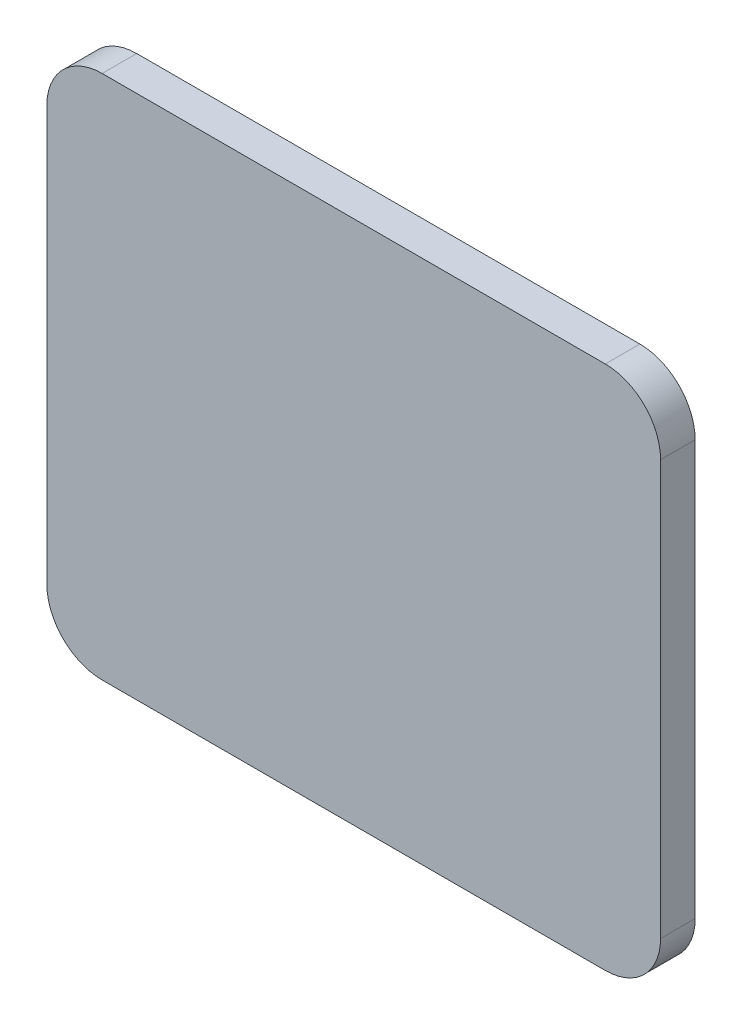
ISO-10303-21;
HEADER;
FILE_DESCRIPTION(('STEP AP214'),'2;1');
FILE_NAME('part.step','',(''),(''),'','','');
FILE_SCHEMA(('AUTOMOTIVE_DESIGN { 1 0 10303 214 1 1 1 1 }'));
ENDSEC;
DATA;
#1=APPLICATION_CONTEXT('core data for automotive mechanical design processes');
#2=APPLICATION_PROTOCOL_DEFINITION('international standard','automotive_design',2000,#1);
#3=PRODUCT_CONTEXT('',#1,'mechanical');
#4=PRODUCT('Part','Part','',(#3));
#5=PRODUCT_RELATED_PRODUCT_CATEGORY('part','',(#4));
#6=PRODUCT_DEFINITION_FORMATION('','',#4);
#7=PRODUCT_DEFINITION_CONTEXT('part definition',#1,'design');
#8=PRODUCT_DEFINITION('design','',#6,#7);
#9=PRODUCT_DEFINITION_SHAPE('','',#8);
#10=(LENGTH_UNIT() NAMED_UNIT(*) SI_UNIT(.MILLI.,.METRE.));
#11=(NAMED_UNIT(*) PLANE_ANGLE_UNIT() SI_UNIT($,.RADIAN.));
#12=(NAMED_UNIT(*) SI_UNIT($,.STERADIAN.) SOLID_ANGLE_UNIT());
#13=UNCERTAINTY_MEASURE_WITH_UNIT(LENGTH_MEASURE(1.E-05),#10,'distance_accuracy_value','');
#14=(GEOMETRIC_REPRESENTATION_CONTEXT(3) GLOBAL_UNCERTAINTY_ASSIGNED_CONTEXT((#13)) GLOBAL_UNIT_ASSIGNED_CONTEXT((#10,
#11,#12)) REPRESENTATION_CONTEXT('',''));
#15=CARTESIAN_POINT('',(0.,0.,0.));
#16=DIRECTION('',(0.,0.,1.));
#17=DIRECTION('',(1.,0.,0.));
#18=AXIS2_PLACEMENT_3D('',#15,#16,#17);
#19=CARTESIAN_POINT('',(-11.557,-9.525,1.5875));
#20=DIRECTION('',(0.,0.,-1.));
#21=DIRECTION('',(-1.,0.,0.));
#22=AXIS2_PLACEMENT_3D('',#19,#20,#21);
#23=CYLINDRICAL_SURFACE('',#22,2.54);
#24=CARTESIAN_POINT('',(-11.557,-9.525,0.));
#25=DIRECTION('',(0.,0.,1.));
#26=DIRECTION('',(-1.,0.,0.));
#27=AXIS2_PLACEMENT_3D('',#24,#25,#26);
#28=CIRCLE('',#27,2.54);
#29=CARTESIAN_POINT('',(-14.097,-9.52499999999998,0.));
#30=VERTEX_POINT('',#29);
#31=CARTESIAN_POINT('',(-11.557,-12.065,0.));
#32=VERTEX_POINT('',#31);
#33=EDGE_CURVE('E130',#30,#32,#28,.T.);
#34=ORIENTED_EDGE('',*,*,#33,.T.);
#35=DIRECTION('',(0.,0.,-1.));
#36=VECTOR('',#35,1.);
#37=CARTESIAN_POINT('',(-11.557,-12.065,1.5875));
#38=LINE('',#37,#36);
#39=CARTESIAN_POINT('',(-11.557,-12.065,1.5875));
#40=VERTEX_POINT('',#39);
#41=EDGE_CURVE('E11',#40,#32,#38,.T.);
#42=ORIENTED_EDGE('',*,*,#41,.F.);
#43=CARTESIAN_POINT('',(-11.557,-9.525,1.5875));
#44=DIRECTION('',(0.,0.,1.));
#45=DIRECTION('',(-1.,0.,0.));
#46=AXIS2_PLACEMENT_3D('',#43,#44,#45);
#47=CIRCLE('',#46,2.54);
#48=CARTESIAN_POINT('',(-14.097,-9.52499999999998,1.5875));
#49=VERTEX_POINT('',#48);
#50=EDGE_CURVE('E144',#49,#40,#47,.T.);
#51=ORIENTED_EDGE('',*,*,#50,.F.);
#52=DIRECTION('',(0.,0.,-1.));
#53=VECTOR('',#52,1.);
#54=CARTESIAN_POINT('',(-14.097,-9.52499999999998,1.5875));
#55=LINE('',#54,#53);
#56=EDGE_CURVE('E126',#49,#30,#55,.T.);
#57=ORIENTED_EDGE('',*,*,#56,.T.);
#58=EDGE_LOOP('',(#34,#42,#51,#57));
#59=FACE_BOUND('',#58,.T.);
#60=ADVANCED_FACE('F34',(#59),#23,.T.);
#61=CARTESIAN_POINT('',(11.557,-12.065,1.5875));
#62=DIRECTION('',(0.,1.,0.));
#63=DIRECTION('',(-1.,0.,0.));
#64=AXIS2_PLACEMENT_3D('',#61,#62,#63);
#65=PLANE('',#64);
#66=DIRECTION('',(1.,0.,0.));
#67=VECTOR('',#66,1.);
#68=CARTESIAN_POINT('',(11.557,-12.065,0.));
#69=LINE('',#68,#67);
#70=CARTESIAN_POINT('',(11.557,-12.065,0.));
#71=VERTEX_POINT('',#70);
#72=EDGE_CURVE('E133',#32,#71,#69,.T.);
#73=ORIENTED_EDGE('',*,*,#72,.T.);
#74=DIRECTION('',(0.,0.,-1.));
#75=VECTOR('',#74,1.);
#76=CARTESIAN_POINT('',(11.557,-12.065,1.5875));
#77=LINE('',#76,#75);
#78=CARTESIAN_POINT('',(11.557,-12.065,1.5875));
#79=VERTEX_POINT('',#78);
#80=EDGE_CURVE('E42',#79,#71,#77,.T.);
#81=ORIENTED_EDGE('',*,*,#80,.F.);
#82=DIRECTION('',(1.,0.,0.));
#83=VECTOR('',#82,1.);
#84=CARTESIAN_POINT('',(11.557,-12.065,1.5875));
#85=LINE('',#84,#83);
#86=EDGE_CURVE('E93',#40,#79,#85,.T.);
#87=ORIENTED_EDGE('',*,*,#86,.F.);
#88=ORIENTED_EDGE('',*,*,#41,.T.);
#89=EDGE_LOOP('',(#73,#81,#87,#88));
#90=FACE_BOUND('',#89,.T.);
#91=ADVANCED_FACE('F179',(#90),#65,.F.);
#92=CARTESIAN_POINT('',(11.557,-9.525,1.5875));
#93=DIRECTION('',(0.,0.,-1.));
#94=DIRECTION('',(-1.,0.,0.));
#95=AXIS2_PLACEMENT_3D('',#92,#93,#94);
#96=CYLINDRICAL_SURFACE('',#95,2.54);
#97=CARTESIAN_POINT('',(11.557,-9.525,0.));
#98=DIRECTION('',(0.,0.,1.));
#99=DIRECTION('',(1.,0.,0.));
#100=AXIS2_PLACEMENT_3D('',#97,#98,#99);
#101=CIRCLE('',#100,2.54);
#102=CARTESIAN_POINT('',(14.097,-9.52499999999998,0.));
#103=VERTEX_POINT('',#102);
#104=EDGE_CURVE('E135',#71,#103,#101,.T.);
#105=ORIENTED_EDGE('',*,*,#104,.T.);
#106=DIRECTION('',(0.,0.,-1.));
#107=VECTOR('',#106,1.);
#108=CARTESIAN_POINT('',(14.097,-9.52499999999998,1.5875));
#109=LINE('',#108,#107);
#110=CARTESIAN_POINT('',(14.097,-9.52499999999998,1.5875));
#111=VERTEX_POINT('',#110);
#112=EDGE_CURVE('E151',#111,#103,#109,.T.);
#113=ORIENTED_EDGE('',*,*,#112,.F.);
#114=CARTESIAN_POINT('',(11.557,-9.525,1.5875));
#115=DIRECTION('',(0.,0.,1.));
#116=DIRECTION('',(1.,0.,0.));
#117=AXIS2_PLACEMENT_3D('',#114,#115,#116);
#118=CIRCLE('',#117,2.54);
#119=EDGE_CURVE('E159',#79,#111,#118,.T.);
#120=ORIENTED_EDGE('',*,*,#119,.F.);
#121=ORIENTED_EDGE('',*,*,#80,.T.);
#122=EDGE_LOOP('',(#105,#113,#120,#121));
#123=FACE_BOUND('',#122,.T.);
#124=ADVANCED_FACE('F157',(#123),#96,.T.);
#125=CARTESIAN_POINT('',(14.097,-9.52499999999998,1.5875));
#126=DIRECTION('',(-1.,0.,0.));
#127=DIRECTION('',(0.,0.,1.));
#128=AXIS2_PLACEMENT_3D('',#125,#126,#127);
#129=PLANE('',#128);
#130=DIRECTION('',(0.,1.,0.));
#131=VECTOR('',#130,1.);
#132=CARTESIAN_POINT('',(14.097,-9.52499999999998,0.));
#133=LINE('',#132,#131);
#134=CARTESIAN_POINT('',(14.097,9.52499999999998,0.));
#135=VERTEX_POINT('',#134);
#136=EDGE_CURVE('E137',#103,#135,#133,.T.);
#137=ORIENTED_EDGE('',*,*,#136,.T.);
#138=DIRECTION('',(0.,0.,-1.));
#139=VECTOR('',#138,1.);
#140=CARTESIAN_POINT('',(14.097,9.52499999999998,1.5875));
#141=LINE('',#140,#139);
#142=CARTESIAN_POINT('',(14.097,9.52499999999998,1.5875));
#143=VERTEX_POINT('',#142);
#144=EDGE_CURVE('E148',#143,#135,#141,.T.);
#145=ORIENTED_EDGE('',*,*,#144,.F.);
#146=DIRECTION('',(0.,1.,0.));
#147=VECTOR('',#146,1.);
#148=CARTESIAN_POINT('',(14.097,-9.52499999999998,1.5875));
#149=LINE('',#148,#147);
#150=EDGE_CURVE('E171',#111,#143,#149,.T.);
#151=ORIENTED_EDGE('',*,*,#150,.F.);
#152=ORIENTED_EDGE('',*,*,#112,.T.);
#153=EDGE_LOOP('',(#137,#145,#151,#152));
#154=FACE_BOUND('',#153,.T.);
#155=ADVANCED_FACE('F167',(#154),#129,.F.);
#156=CARTESIAN_POINT('',(11.557,9.525,1.5875));
#157=DIRECTION('',(0.,0.,-1.));
#158=DIRECTION('',(-1.,0.,0.));
#159=AXIS2_PLACEMENT_3D('',#156,#157,#158);
#160=CYLINDRICAL_SURFACE('',#159,2.54);
#161=CARTESIAN_POINT('',(11.557,9.525,0.));
#162=DIRECTION('',(0.,0.,1.));
#163=DIRECTION('',(1.,0.,0.));
#164=AXIS2_PLACEMENT_3D('',#161,#162,#163);
#165=CIRCLE('',#164,2.54);
#166=CARTESIAN_POINT('',(11.557,12.065,0.));
#167=VERTEX_POINT('',#166);
#168=EDGE_CURVE('E139',#135,#167,#165,.T.);
#169=ORIENTED_EDGE('',*,*,#168,.T.);
#170=DIRECTION('',(0.,0.,-1.));
#171=VECTOR('',#170,1.);
#172=CARTESIAN_POINT('',(11.557,12.065,1.5875));
#173=LINE('',#172,#171);
#174=CARTESIAN_POINT('',(11.557,12.065,1.5875));
#175=VERTEX_POINT('',#174);
#176=EDGE_CURVE('E121',#175,#167,#173,.T.);
#177=ORIENTED_EDGE('',*,*,#176,.F.);
#178=CARTESIAN_POINT('',(11.557,9.525,1.5875));
#179=DIRECTION('',(0.,0.,1.));
#180=DIRECTION('',(1.,0.,0.));
#181=AXIS2_PLACEMENT_3D('',#178,#179,#180);
#182=CIRCLE('',#181,2.54);
#183=EDGE_CURVE('E112',#143,#175,#182,.T.);
#184=ORIENTED_EDGE('',*,*,#183,.F.);
#185=ORIENTED_EDGE('',*,*,#144,.T.);
#186=EDGE_LOOP('',(#169,#177,#184,#185));
#187=FACE_BOUND('',#186,.T.);
#188=ADVANCED_FACE('F170',(#187),#160,.T.);
#189=CARTESIAN_POINT('',(11.557,12.065,1.5875));
#190=DIRECTION('',(0.,-1.,0.));
#191=DIRECTION('',(1.,0.,0.));
#192=AXIS2_PLACEMENT_3D('',#189,#190,#191);
#193=PLANE('',#192);
#194=DIRECTION('',(-1.,0.,0.));
#195=VECTOR('',#194,1.);
#196=CARTESIAN_POINT('',(11.557,12.065,0.));
#197=LINE('',#196,#195);
#198=CARTESIAN_POINT('',(-11.557,12.065,0.));
#199=VERTEX_POINT('',#198);
#200=EDGE_CURVE('E120',#167,#199,#197,.T.);
#201=ORIENTED_EDGE('',*,*,#200,.T.);
#202=DIRECTION('',(0.,0.,-1.));
#203=VECTOR('',#202,1.);
#204=CARTESIAN_POINT('',(-11.557,12.065,1.5875));
#205=LINE('',#204,#203);
#206=CARTESIAN_POINT('',(-11.557,12.065,1.5875));
#207=VERTEX_POINT('',#206);
#208=EDGE_CURVE('E117',#207,#199,#205,.T.);
#209=ORIENTED_EDGE('',*,*,#208,.F.);
#210=DIRECTION('',(-1.,0.,0.));
#211=VECTOR('',#210,1.);
#212=CARTESIAN_POINT('',(11.557,12.065,1.5875));
#213=LINE('',#212,#211);
#214=EDGE_CURVE('E106',#175,#207,#213,.T.);
#215=ORIENTED_EDGE('',*,*,#214,.F.);
#216=ORIENTED_EDGE('',*,*,#176,.T.);
#217=EDGE_LOOP('',(#201,#209,#215,#216));
#218=FACE_BOUND('',#217,.T.);
#219=ADVANCED_FACE('F118',(#218),#193,.F.);
#220=CARTESIAN_POINT('',(-11.557,9.525,1.5875));
#221=DIRECTION('',(0.,0.,-1.));
#222=DIRECTION('',(-1.,0.,0.));
#223=AXIS2_PLACEMENT_3D('',#220,#221,#222);
#224=CYLINDRICAL_SURFACE('',#223,2.54);
#225=CARTESIAN_POINT('',(-11.557,9.525,0.));
#226=DIRECTION('',(0.,0.,1.));
#227=DIRECTION('',(1.,0.,0.));
#228=AXIS2_PLACEMENT_3D('',#225,#226,#227);
#229=CIRCLE('',#228,2.54);
#230=CARTESIAN_POINT('',(-14.097,9.52499999999998,0.));
#231=VERTEX_POINT('',#230);
#232=EDGE_CURVE('E79',#199,#231,#229,.T.);
#233=ORIENTED_EDGE('',*,*,#232,.T.);
#234=DIRECTION('',(0.,0.,-1.));
#235=VECTOR('',#234,1.);
#236=CARTESIAN_POINT('',(-14.097,9.52499999999998,1.5875));
#237=LINE('',#236,#235);
#238=CARTESIAN_POINT('',(-14.097,9.52499999999998,1.5875));
#239=VERTEX_POINT('',#238);
#240=EDGE_CURVE('E122',#239,#231,#237,.T.);
#241=ORIENTED_EDGE('',*,*,#240,.F.);
#242=CARTESIAN_POINT('',(-11.557,9.525,1.5875));
#243=DIRECTION('',(0.,0.,1.));
#244=DIRECTION('',(1.,0.,0.));
#245=AXIS2_PLACEMENT_3D('',#242,#243,#244);
#246=CIRCLE('',#245,2.54);
#247=EDGE_CURVE('E110',#207,#239,#246,.T.);
#248=ORIENTED_EDGE('',*,*,#247,.F.);
#249=ORIENTED_EDGE('',*,*,#208,.T.);
#250=EDGE_LOOP('',(#233,#241,#248,#249));
#251=FACE_BOUND('',#250,.T.);
#252=ADVANCED_FACE('F124',(#251),#224,.T.);
#253=CARTESIAN_POINT('',(-14.097,-9.52499999999998,1.5875));
#254=DIRECTION('',(1.,0.,0.));
#255=DIRECTION('',(0.,0.,-1.));
#256=AXIS2_PLACEMENT_3D('',#253,#254,#255);
#257=PLANE('',#256);
#258=DIRECTION('',(0.,-1.,0.));
#259=VECTOR('',#258,1.);
#260=CARTESIAN_POINT('',(-14.097,-9.52499999999998,0.));
#261=LINE('',#260,#259);
#262=EDGE_CURVE('E85',#231,#30,#261,.T.);
#263=ORIENTED_EDGE('',*,*,#262,.T.);
#264=ORIENTED_EDGE('',*,*,#56,.F.);
#265=DIRECTION('',(0.,-1.,0.));
#266=VECTOR('',#265,1.);
#267=CARTESIAN_POINT('',(-14.097,-9.52499999999998,1.5875));
#268=LINE('',#267,#266);
#269=EDGE_CURVE('E50',#239,#49,#268,.T.);
#270=ORIENTED_EDGE('',*,*,#269,.F.);
#271=ORIENTED_EDGE('',*,*,#240,.T.);
#272=EDGE_LOOP('',(#263,#264,#270,#271));
#273=FACE_BOUND('',#272,.T.);
#274=ADVANCED_FACE('F195',(#273),#257,.F.);
#275=CARTESIAN_POINT('',(-11.557,-9.525,1.5875));
#276=DIRECTION('',(0.,0.,-1.));
#277=DIRECTION('',(-1.,0.,0.));
#278=AXIS2_PLACEMENT_3D('',#275,#276,#277);
#279=PLANE('',#278);
#280=ORIENTED_EDGE('',*,*,#50,.T.);
#281=ORIENTED_EDGE('',*,*,#86,.T.);
#282=ORIENTED_EDGE('',*,*,#119,.T.);
#283=ORIENTED_EDGE('',*,*,#150,.T.);
#284=ORIENTED_EDGE('',*,*,#183,.T.);
#285=ORIENTED_EDGE('',*,*,#214,.T.);
#286=ORIENTED_EDGE('',*,*,#247,.T.);
#287=ORIENTED_EDGE('',*,*,#269,.T.);
#288=EDGE_LOOP('',(#280,#281,#282,#283,#284,#285,#286,#287));
#289=FACE_BOUND('',#288,.T.);
#290=ADVANCED_FACE('F108',(#289),#279,.F.);
#291=CARTESIAN_POINT('',(-11.557,-9.525,0.));
#292=DIRECTION('',(0.,0.,-1.));
#293=DIRECTION('',(-1.,0.,0.));
#294=AXIS2_PLACEMENT_3D('',#291,#292,#293);
#295=PLANE('',#294);
#296=ORIENTED_EDGE('',*,*,#33,.F.);
#297=ORIENTED_EDGE('',*,*,#262,.F.);
#298=ORIENTED_EDGE('',*,*,#232,.F.);
#299=ORIENTED_EDGE('',*,*,#200,.F.);
#300=ORIENTED_EDGE('',*,*,#168,.F.);
#301=ORIENTED_EDGE('',*,*,#136,.F.);
#302=ORIENTED_EDGE('',*,*,#104,.F.);
#303=ORIENTED_EDGE('',*,*,#72,.F.);
#304=EDGE_LOOP('',(#296,#297,#298,#299,#300,#301,#302,#303));
#305=FACE_BOUND('',#304,.T.);
#306=ADVANCED_FACE('F163',(#305),#295,.T.);
#307=CLOSED_SHELL('',(#60,#91,#124,#155,#188,#219,#252,#274,#290,#306));
#308=MANIFOLD_SOLID_BREP('B2',#307);
#309=ADVANCED_BREP_SHAPE_REPRESENTATION('',(#18,#308),#14);
#310=SHAPE_DEFINITION_REPRESENTATION(#9,#309);
ENDSEC;
END-ISO-10303-21;
